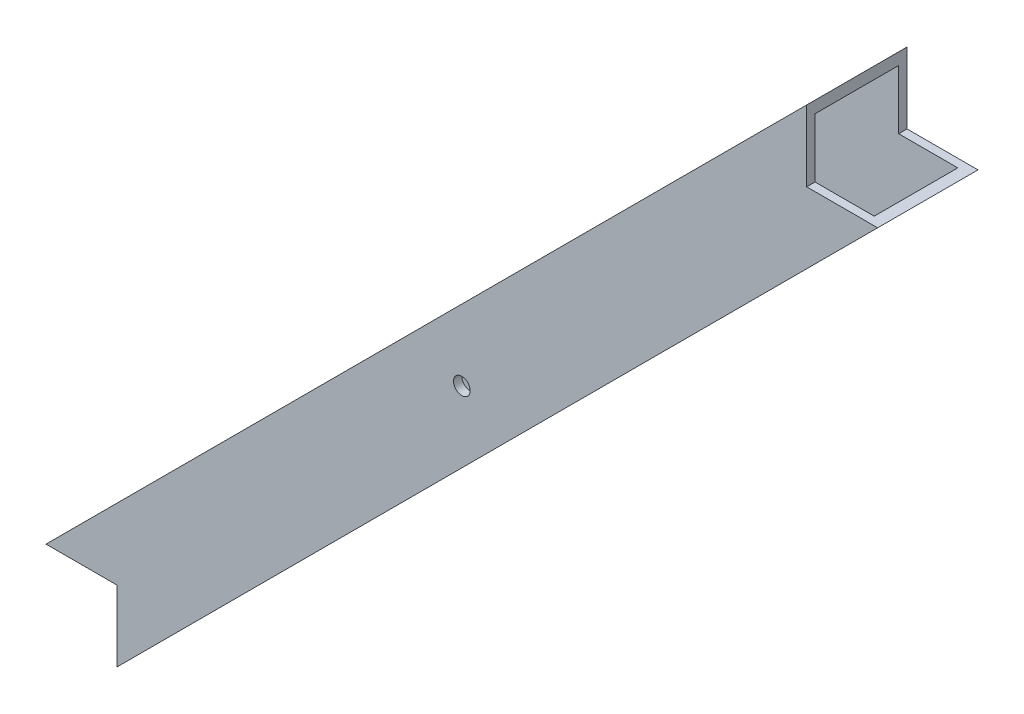
ISO-10303-21;
HEADER;
FILE_DESCRIPTION(('STEP AP214'),'2;1');
FILE_NAME('part.step','',(''),(''),'','','');
FILE_SCHEMA(('AUTOMOTIVE_DESIGN { 1 0 10303 214 1 1 1 1 }'));
ENDSEC;
DATA;
#1=APPLICATION_CONTEXT('core data for automotive mechanical design processes');
#2=APPLICATION_PROTOCOL_DEFINITION('international standard','automotive_design',2000,#1);
#3=PRODUCT_CONTEXT('',#1,'mechanical');
#4=PRODUCT('Part','Part','',(#3));
#5=PRODUCT_RELATED_PRODUCT_CATEGORY('part','',(#4));
#6=PRODUCT_DEFINITION_FORMATION('','',#4);
#7=PRODUCT_DEFINITION_CONTEXT('part definition',#1,'design');
#8=PRODUCT_DEFINITION('design','',#6,#7);
#9=PRODUCT_DEFINITION_SHAPE('','',#8);
#10=(LENGTH_UNIT() NAMED_UNIT(*) SI_UNIT(.MILLI.,.METRE.));
#11=(NAMED_UNIT(*) PLANE_ANGLE_UNIT() SI_UNIT($,.RADIAN.));
#12=(NAMED_UNIT(*) SI_UNIT($,.STERADIAN.) SOLID_ANGLE_UNIT());
#13=UNCERTAINTY_MEASURE_WITH_UNIT(LENGTH_MEASURE(1.E-05),#10,'distance_accuracy_value','');
#14=(GEOMETRIC_REPRESENTATION_CONTEXT(3) GLOBAL_UNCERTAINTY_ASSIGNED_CONTEXT((#13)) GLOBAL_UNIT_ASSIGNED_CONTEXT((#10,
#11,#12)) REPRESENTATION_CONTEXT('',''));
#15=CARTESIAN_POINT('',(0.,0.,0.));
#16=DIRECTION('',(0.,0.,1.));
#17=DIRECTION('',(1.,0.,0.));
#18=AXIS2_PLACEMENT_3D('',#15,#16,#17);
#19=CARTESIAN_POINT('',(150.,150.,-38.1));
#20=DIRECTION('',(0.,0.,1.));
#21=DIRECTION('',(1.,0.,0.));
#22=AXIS2_PLACEMENT_3D('',#19,#20,#21);
#23=CYLINDRICAL_SURFACE('',#22,3.175);
#24=CARTESIAN_POINT('',(150.,150.,0.));
#25=DIRECTION('',(0.,0.,1.));
#26=DIRECTION('',(1.,0.,0.));
#27=AXIS2_PLACEMENT_3D('',#24,#25,#26);
#28=CIRCLE('',#27,3.175);
#29=CARTESIAN_POINT('',(153.175,150.,0.));
#30=VERTEX_POINT('',#29);
#31=EDGE_CURVE('E197',#30,#30,#28,.T.);
#32=ORIENTED_EDGE('',*,*,#31,.T.);
#33=EDGE_LOOP('',(#32));
#34=FACE_BOUND('',#33,.T.);
#35=CARTESIAN_POINT('',(150.,150.,-3.175));
#36=DIRECTION('',(0.,0.,-1.));
#37=DIRECTION('',(-1.,0.,0.));
#38=AXIS2_PLACEMENT_3D('',#35,#36,#37);
#39=CIRCLE('',#38,3.175);
#40=CARTESIAN_POINT('',(146.825,150.,-3.175));
#41=VERTEX_POINT('',#40);
#42=EDGE_CURVE('E249',#41,#41,#39,.F.);
#43=ORIENTED_EDGE('',*,*,#42,.F.);
#44=EDGE_LOOP('',(#43));
#45=FACE_BOUND('',#44,.T.);
#46=ADVANCED_FACE('F40',(#34,#45),#23,.F.);
#47=CARTESIAN_POINT('',(0.,19.05,-38.1));
#48=DIRECTION('',(0.,1.,0.));
#49=DIRECTION('',(0.,0.,1.));
#50=AXIS2_PLACEMENT_3D('',#47,#48,#49);
#51=PLANE('',#50);
#52=DIRECTION('',(0.,0.,1.));
#53=VECTOR('',#52,1.);
#54=CARTESIAN_POINT('',(19.05,19.05,-38.1));
#55=LINE('',#54,#53);
#56=CARTESIAN_POINT('',(19.05,19.05,-38.1));
#57=VERTEX_POINT('',#56);
#58=CARTESIAN_POINT('',(19.05,19.05,-34.925));
#59=VERTEX_POINT('',#58);
#60=EDGE_CURVE('E153',#57,#59,#55,.T.);
#61=ORIENTED_EDGE('',*,*,#60,.T.);
#62=DIRECTION('',(-1.,0.,0.));
#63=VECTOR('',#62,1.);
#64=CARTESIAN_POINT('',(0.,19.05,-34.925));
#65=LINE('',#64,#63);
#66=CARTESIAN_POINT('',(-3.40064030267279,19.0500000000001,-34.925));
#67=VERTEX_POINT('',#66);
#68=EDGE_CURVE('E240',#59,#67,#65,.T.);
#69=ORIENTED_EDGE('',*,*,#68,.T.);
#70=DIRECTION('',(0.,0.,1.));
#71=VECTOR('',#70,1.);
#72=CARTESIAN_POINT('',(-3.40064030267284,19.05,-38.1));
#73=LINE('',#72,#71);
#74=CARTESIAN_POINT('',(-3.40064030267284,19.05,-3.175));
#75=VERTEX_POINT('',#74);
#76=EDGE_CURVE('E201',#67,#75,#73,.T.);
#77=ORIENTED_EDGE('',*,*,#76,.T.);
#78=DIRECTION('',(-1.,0.,0.));
#79=VECTOR('',#78,1.);
#80=CARTESIAN_POINT('',(0.,19.05,-3.175));
#81=LINE('',#80,#79);
#82=CARTESIAN_POINT('',(19.05,19.05,-3.175));
#83=VERTEX_POINT('',#82);
#84=EDGE_CURVE('E253',#83,#75,#81,.T.);
#85=ORIENTED_EDGE('',*,*,#84,.F.);
#86=CARTESIAN_POINT('',(19.05,19.05,0.));
#87=VERTEX_POINT('',#86);
#88=EDGE_CURVE('E148',#83,#87,#55,.T.);
#89=ORIENTED_EDGE('',*,*,#88,.T.);
#90=DIRECTION('',(-1.,0.,0.));
#91=VECTOR('',#90,1.);
#92=CARTESIAN_POINT('',(0.,19.05,0.));
#93=LINE('',#92,#91);
#94=CARTESIAN_POINT('',(-7.8907683632074,19.05,0.));
#95=VERTEX_POINT('',#94);
#96=EDGE_CURVE('E193',#87,#95,#93,.T.);
#97=ORIENTED_EDGE('',*,*,#96,.T.);
#98=DIRECTION('',(0.,0.,1.));
#99=VECTOR('',#98,1.);
#100=CARTESIAN_POINT('',(-7.8907683632074,19.05,-38.1));
#101=LINE('',#100,#99);
#102=CARTESIAN_POINT('',(-7.8907683632074,19.05,-38.1));
#103=VERTEX_POINT('',#102);
#104=EDGE_CURVE('E134',#103,#95,#101,.T.);
#105=ORIENTED_EDGE('',*,*,#104,.F.);
#106=DIRECTION('',(-1.,0.,0.));
#107=VECTOR('',#106,1.);
#108=CARTESIAN_POINT('',(0.,19.05,-38.1));
#109=LINE('',#108,#107);
#110=EDGE_CURVE('E219',#57,#103,#109,.T.);
#111=ORIENTED_EDGE('',*,*,#110,.F.);
#112=EDGE_LOOP('',(#61,#69,#77,#85,#89,#97,#105,#111));
#113=FACE_BOUND('',#112,.T.);
#114=ADVANCED_FACE('F272',(#113),#51,.F.);
#115=CARTESIAN_POINT('',(-13.4703841816037,13.4703841816037,-38.1));
#116=DIRECTION('',(-0.707106781186547,0.707106781186548,0.));
#117=DIRECTION('',(-0.707106781186548,-0.707106781186547,0.));
#118=AXIS2_PLACEMENT_3D('',#115,#116,#117);
#119=PLANE('',#118);
#120=DIRECTION('',(-0.707106781186548,-0.707106781186547,0.));
#121=VECTOR('',#120,1.);
#122=CARTESIAN_POINT('',(-13.4703841816037,13.4703841816037,0.));
#123=LINE('',#122,#121);
#124=CARTESIAN_POINT('',(280.95,307.890768363207,0.));
#125=VERTEX_POINT('',#124);
#126=EDGE_CURVE('E173',#125,#95,#123,.T.);
#127=ORIENTED_EDGE('',*,*,#126,.F.);
#128=DIRECTION('',(0.,0.,1.));
#129=VECTOR('',#128,1.);
#130=CARTESIAN_POINT('',(280.95,307.890768363207,-38.1));
#131=LINE('',#130,#129);
#132=CARTESIAN_POINT('',(280.95,307.890768363207,-38.1));
#133=VERTEX_POINT('',#132);
#134=EDGE_CURVE('E168',#133,#125,#131,.T.);
#135=ORIENTED_EDGE('',*,*,#134,.F.);
#136=DIRECTION('',(-0.707106781186548,-0.707106781186547,0.));
#137=VECTOR('',#136,1.);
#138=CARTESIAN_POINT('',(-13.4703841816037,13.4703841816037,-38.1));
#139=LINE('',#138,#137);
#140=EDGE_CURVE('E202',#133,#103,#139,.T.);
#141=ORIENTED_EDGE('',*,*,#140,.T.);
#142=ORIENTED_EDGE('',*,*,#104,.T.);
#143=EDGE_LOOP('',(#127,#135,#141,#142));
#144=FACE_BOUND('',#143,.T.);
#145=ADVANCED_FACE('F301',(#144),#119,.T.);
#146=CARTESIAN_POINT('',(280.95,0.,-38.1));
#147=DIRECTION('',(-1.,0.,0.));
#148=DIRECTION('',(0.,0.,1.));
#149=AXIS2_PLACEMENT_3D('',#146,#147,#148);
#150=PLANE('',#149);
#151=DIRECTION('',(0.,0.,-1.));
#152=VECTOR('',#151,1.);
#153=CARTESIAN_POINT('',(280.95,303.400640302673,-38.1));
#154=LINE('',#153,#152);
#155=CARTESIAN_POINT('',(280.95,303.400640302673,-3.175));
#156=VERTEX_POINT('',#155);
#157=CARTESIAN_POINT('',(280.95,303.400640302673,-34.925));
#158=VERTEX_POINT('',#157);
#159=EDGE_CURVE('E11',#156,#158,#154,.T.);
#160=ORIENTED_EDGE('',*,*,#159,.T.);
#161=DIRECTION('',(0.,-1.,0.));
#162=VECTOR('',#161,1.);
#163=CARTESIAN_POINT('',(280.95,0.,-34.925));
#164=LINE('',#163,#162);
#165=CARTESIAN_POINT('',(280.95,280.95,-34.925));
#166=VERTEX_POINT('',#165);
#167=EDGE_CURVE('E228',#158,#166,#164,.T.);
#168=ORIENTED_EDGE('',*,*,#167,.T.);
#169=DIRECTION('',(0.,0.,1.));
#170=VECTOR('',#169,1.);
#171=CARTESIAN_POINT('',(280.95,280.95,-38.1));
#172=LINE('',#171,#170);
#173=CARTESIAN_POINT('',(280.95,280.95,-38.1));
#174=VERTEX_POINT('',#173);
#175=EDGE_CURVE('E164',#174,#166,#172,.T.);
#176=ORIENTED_EDGE('',*,*,#175,.F.);
#177=DIRECTION('',(0.,-1.,0.));
#178=VECTOR('',#177,1.);
#179=CARTESIAN_POINT('',(280.95,0.,-38.1));
#180=LINE('',#179,#178);
#181=EDGE_CURVE('E206',#133,#174,#180,.T.);
#182=ORIENTED_EDGE('',*,*,#181,.F.);
#183=ORIENTED_EDGE('',*,*,#134,.T.);
#184=DIRECTION('',(0.,-1.,0.));
#185=VECTOR('',#184,1.);
#186=CARTESIAN_POINT('',(280.95,0.,0.));
#187=LINE('',#186,#185);
#188=CARTESIAN_POINT('',(280.95,280.95,0.));
#189=VERTEX_POINT('',#188);
#190=EDGE_CURVE('E178',#125,#189,#187,.T.);
#191=ORIENTED_EDGE('',*,*,#190,.T.);
#192=CARTESIAN_POINT('',(280.95,280.95,-3.175));
#193=VERTEX_POINT('',#192);
#194=EDGE_CURVE('E163',#193,#189,#172,.T.);
#195=ORIENTED_EDGE('',*,*,#194,.F.);
#196=DIRECTION('',(0.,-1.,0.));
#197=VECTOR('',#196,1.);
#198=CARTESIAN_POINT('',(280.95,0.,-3.175));
#199=LINE('',#198,#197);
#200=EDGE_CURVE('E244',#156,#193,#199,.T.);
#201=ORIENTED_EDGE('',*,*,#200,.F.);
#202=EDGE_LOOP('',(#160,#168,#176,#182,#183,#191,#195,#201));
#203=FACE_BOUND('',#202,.T.);
#204=ADVANCED_FACE('F285',(#203),#150,.F.);
#205=CARTESIAN_POINT('',(0.,280.95,-38.1));
#206=DIRECTION('',(0.,-1.,0.));
#207=DIRECTION('',(0.,0.,-1.));
#208=AXIS2_PLACEMENT_3D('',#205,#206,#207);
#209=PLANE('',#208);
#210=ORIENTED_EDGE('',*,*,#175,.T.);
#211=DIRECTION('',(1.,0.,0.));
#212=VECTOR('',#211,1.);
#213=CARTESIAN_POINT('',(0.,280.95,-34.925));
#214=LINE('',#213,#212);
#215=CARTESIAN_POINT('',(303.400640302673,280.95,-34.925));
#216=VERTEX_POINT('',#215);
#217=EDGE_CURVE('E232',#166,#216,#214,.T.);
#218=ORIENTED_EDGE('',*,*,#217,.T.);
#219=DIRECTION('',(0.,0.,-1.));
#220=VECTOR('',#219,1.);
#221=CARTESIAN_POINT('',(303.400640302673,280.95,-38.1));
#222=LINE('',#221,#220);
#223=CARTESIAN_POINT('',(303.400640302673,280.95,-3.175));
#224=VERTEX_POINT('',#223);
#225=EDGE_CURVE('E256',#224,#216,#222,.T.);
#226=ORIENTED_EDGE('',*,*,#225,.F.);
#227=DIRECTION('',(1.,0.,0.));
#228=VECTOR('',#227,1.);
#229=CARTESIAN_POINT('',(0.,280.95,-3.175));
#230=LINE('',#229,#228);
#231=EDGE_CURVE('E140',#193,#224,#230,.T.);
#232=ORIENTED_EDGE('',*,*,#231,.F.);
#233=ORIENTED_EDGE('',*,*,#194,.T.);
#234=DIRECTION('',(1.,0.,0.));
#235=VECTOR('',#234,1.);
#236=CARTESIAN_POINT('',(0.,280.95,0.));
#237=LINE('',#236,#235);
#238=CARTESIAN_POINT('',(307.890768363207,280.95,0.));
#239=VERTEX_POINT('',#238);
#240=EDGE_CURVE('E182',#189,#239,#237,.T.);
#241=ORIENTED_EDGE('',*,*,#240,.T.);
#242=DIRECTION('',(0.,0.,1.));
#243=VECTOR('',#242,1.);
#244=CARTESIAN_POINT('',(307.890768363207,280.95,-38.1));
#245=LINE('',#244,#243);
#246=CARTESIAN_POINT('',(307.890768363207,280.95,-38.1));
#247=VERTEX_POINT('',#246);
#248=EDGE_CURVE('E160',#247,#239,#245,.T.);
#249=ORIENTED_EDGE('',*,*,#248,.F.);
#250=DIRECTION('',(1.,0.,0.));
#251=VECTOR('',#250,1.);
#252=CARTESIAN_POINT('',(0.,280.95,-38.1));
#253=LINE('',#252,#251);
#254=EDGE_CURVE('E209',#174,#247,#253,.T.);
#255=ORIENTED_EDGE('',*,*,#254,.F.);
#256=EDGE_LOOP('',(#210,#218,#226,#232,#233,#241,#249,#255));
#257=FACE_BOUND('',#256,.T.);
#258=ADVANCED_FACE('F279',(#257),#209,.F.);
#259=CARTESIAN_POINT('',(13.4703841816038,-13.4703841816038,-38.1));
#260=DIRECTION('',(0.707106781186548,-0.707106781186548,0.));
#261=DIRECTION('',(0.707106781186548,0.707106781186548,0.));
#262=AXIS2_PLACEMENT_3D('',#259,#260,#261);
#263=PLANE('',#262);
#264=DIRECTION('',(0.707106781186548,0.707106781186548,0.));
#265=VECTOR('',#264,1.);
#266=CARTESIAN_POINT('',(13.4703841816038,-13.4703841816038,0.));
#267=LINE('',#266,#265);
#268=CARTESIAN_POINT('',(19.05,-7.89076836320756,0.));
#269=VERTEX_POINT('',#268);
#270=EDGE_CURVE('E186',#269,#239,#267,.T.);
#271=ORIENTED_EDGE('',*,*,#270,.F.);
#272=DIRECTION('',(0.,0.,1.));
#273=VECTOR('',#272,1.);
#274=CARTESIAN_POINT('',(19.05,-7.89076836320756,-38.1));
#275=LINE('',#274,#273);
#276=CARTESIAN_POINT('',(19.05,-7.89076836320756,-38.1));
#277=VERTEX_POINT('',#276);
#278=EDGE_CURVE('E157',#277,#269,#275,.T.);
#279=ORIENTED_EDGE('',*,*,#278,.F.);
#280=DIRECTION('',(0.707106781186548,0.707106781186548,0.));
#281=VECTOR('',#280,1.);
#282=CARTESIAN_POINT('',(13.4703841816038,-13.4703841816038,-38.1));
#283=LINE('',#282,#281);
#284=EDGE_CURVE('E212',#277,#247,#283,.T.);
#285=ORIENTED_EDGE('',*,*,#284,.T.);
#286=ORIENTED_EDGE('',*,*,#248,.T.);
#287=EDGE_LOOP('',(#271,#279,#285,#286));
#288=FACE_BOUND('',#287,.T.);
#289=ADVANCED_FACE('F305',(#288),#263,.T.);
#290=CARTESIAN_POINT('',(150.,150.,-34.925));
#291=DIRECTION('',(0.,0.,-1.));
#292=DIRECTION('',(-1.,0.,0.));
#293=AXIS2_PLACEMENT_3D('',#290,#291,#292);
#294=CIRCLE('',#293,3.175);
#295=CARTESIAN_POINT('',(146.825,150.,-34.925));
#296=VERTEX_POINT('',#295);
#297=EDGE_CURVE('E236',#296,#296,#294,.F.);
#298=ORIENTED_EDGE('',*,*,#297,.T.);
#299=EDGE_LOOP('',(#298));
#300=FACE_BOUND('',#299,.T.);
#301=CARTESIAN_POINT('',(150.,150.,-38.1));
#302=DIRECTION('',(0.,0.,1.));
#303=DIRECTION('',(1.,0.,0.));
#304=AXIS2_PLACEMENT_3D('',#301,#302,#303);
#305=CIRCLE('',#304,3.175);
#306=CARTESIAN_POINT('',(153.175,150.,-38.1));
#307=VERTEX_POINT('',#306);
#308=EDGE_CURVE('E177',#307,#307,#305,.T.);
#309=ORIENTED_EDGE('',*,*,#308,.F.);
#310=EDGE_LOOP('',(#309));
#311=FACE_BOUND('',#310,.T.);
#312=ADVANCED_FACE('F42',(#300,#311),#23,.F.);
#313=CARTESIAN_POINT('',(19.05,0.,-38.1));
#314=DIRECTION('',(1.,0.,0.));
#315=DIRECTION('',(0.,0.,-1.));
#316=AXIS2_PLACEMENT_3D('',#313,#314,#315);
#317=PLANE('',#316);
#318=DIRECTION('',(0.,0.,1.));
#319=VECTOR('',#318,1.);
#320=CARTESIAN_POINT('',(19.05,-3.40064030267284,-38.1));
#321=LINE('',#320,#319);
#322=CARTESIAN_POINT('',(19.05,-3.40064030267284,-34.925));
#323=VERTEX_POINT('',#322);
#324=CARTESIAN_POINT('',(19.0500000000001,-3.40064030267279,-3.175));
#325=VERTEX_POINT('',#324);
#326=EDGE_CURVE('E127',#323,#325,#321,.T.);
#327=ORIENTED_EDGE('',*,*,#326,.F.);
#328=DIRECTION('',(0.,1.,0.));
#329=VECTOR('',#328,1.);
#330=CARTESIAN_POINT('',(19.05,0.,-34.925));
#331=LINE('',#330,#329);
#332=EDGE_CURVE('E49',#323,#59,#331,.T.);
#333=ORIENTED_EDGE('',*,*,#332,.T.);
#334=ORIENTED_EDGE('',*,*,#60,.F.);
#335=DIRECTION('',(0.,1.,0.));
#336=VECTOR('',#335,1.);
#337=CARTESIAN_POINT('',(19.05,0.,-38.1));
#338=LINE('',#337,#336);
#339=EDGE_CURVE('E216',#277,#57,#338,.T.);
#340=ORIENTED_EDGE('',*,*,#339,.F.);
#341=ORIENTED_EDGE('',*,*,#278,.T.);
#342=DIRECTION('',(0.,1.,0.));
#343=VECTOR('',#342,1.);
#344=CARTESIAN_POINT('',(19.05,0.,0.));
#345=LINE('',#344,#343);
#346=EDGE_CURVE('E190',#269,#87,#345,.T.);
#347=ORIENTED_EDGE('',*,*,#346,.T.);
#348=ORIENTED_EDGE('',*,*,#88,.F.);
#349=DIRECTION('',(0.,1.,0.));
#350=VECTOR('',#349,1.);
#351=CARTESIAN_POINT('',(19.05,0.,-3.175));
#352=LINE('',#351,#350);
#353=EDGE_CURVE('E133',#325,#83,#352,.T.);
#354=ORIENTED_EDGE('',*,*,#353,.F.);
#355=EDGE_LOOP('',(#327,#333,#334,#340,#341,#347,#348,#354));
#356=FACE_BOUND('',#355,.T.);
#357=ADVANCED_FACE('F146',(#356),#317,.F.);
#358=CARTESIAN_POINT('',(0.,0.,-38.1));
#359=DIRECTION('',(0.,0.,1.));
#360=DIRECTION('',(1.,0.,0.));
#361=AXIS2_PLACEMENT_3D('',#358,#359,#360);
#362=PLANE('',#361);
#363=ORIENTED_EDGE('',*,*,#308,.T.);
#364=EDGE_LOOP('',(#363));
#365=FACE_BOUND('',#364,.T.);
#366=ORIENTED_EDGE('',*,*,#110,.T.);
#367=ORIENTED_EDGE('',*,*,#140,.F.);
#368=ORIENTED_EDGE('',*,*,#181,.T.);
#369=ORIENTED_EDGE('',*,*,#254,.T.);
#370=ORIENTED_EDGE('',*,*,#284,.F.);
#371=ORIENTED_EDGE('',*,*,#339,.T.);
#372=EDGE_LOOP('',(#366,#367,#368,#369,#370,#371));
#373=FACE_BOUND('',#372,.T.);
#374=ADVANCED_FACE('F303',(#365,#373),#362,.F.);
#375=CARTESIAN_POINT('',(0.,0.,0.));
#376=DIRECTION('',(0.,0.,1.));
#377=DIRECTION('',(1.,0.,0.));
#378=AXIS2_PLACEMENT_3D('',#375,#376,#377);
#379=PLANE('',#378);
#380=ORIENTED_EDGE('',*,*,#31,.F.);
#381=EDGE_LOOP('',(#380));
#382=FACE_BOUND('',#381,.T.);
#383=ORIENTED_EDGE('',*,*,#96,.F.);
#384=ORIENTED_EDGE('',*,*,#346,.F.);
#385=ORIENTED_EDGE('',*,*,#270,.T.);
#386=ORIENTED_EDGE('',*,*,#240,.F.);
#387=ORIENTED_EDGE('',*,*,#190,.F.);
#388=ORIENTED_EDGE('',*,*,#126,.T.);
#389=EDGE_LOOP('',(#383,#384,#385,#386,#387,#388));
#390=FACE_BOUND('',#389,.T.);
#391=ADVANCED_FACE('F296',(#382,#390),#379,.T.);
#392=CARTESIAN_POINT('',(296.665448211871,319.116088514544,-3.175));
#393=DIRECTION('',(-0.707106781186547,0.707106781186547,0.));
#394=DIRECTION('',(-0.707106781186548,-0.707106781186548,0.));
#395=AXIS2_PLACEMENT_3D('',#392,#393,#394);
#396=PLANE('',#395);
#397=DIRECTION('',(-0.707106781186547,-0.707106781186547,0.));
#398=VECTOR('',#397,1.);
#399=CARTESIAN_POINT('',(296.665448211871,319.116088514544,-34.925));
#400=LINE('',#399,#398);
#401=EDGE_CURVE('E259',#158,#67,#400,.T.);
#402=ORIENTED_EDGE('',*,*,#401,.F.);
#403=ORIENTED_EDGE('',*,*,#159,.F.);
#404=DIRECTION('',(-0.707106781186547,-0.707106781186547,0.));
#405=VECTOR('',#404,1.);
#406=CARTESIAN_POINT('',(296.665448211871,319.116088514544,-3.175));
#407=LINE('',#406,#405);
#408=EDGE_CURVE('E143',#156,#75,#407,.T.);
#409=ORIENTED_EDGE('',*,*,#408,.T.);
#410=ORIENTED_EDGE('',*,*,#76,.F.);
#411=EDGE_LOOP('',(#402,#403,#409,#410));
#412=FACE_BOUND('',#411,.T.);
#413=ADVANCED_FACE('F290',(#412),#396,.F.);
#414=CARTESIAN_POINT('',(296.665448211871,319.116088514544,-34.925));
#415=DIRECTION('',(0.,0.,-1.));
#416=DIRECTION('',(-1.,0.,0.));
#417=AXIS2_PLACEMENT_3D('',#414,#415,#416);
#418=PLANE('',#417);
#419=ORIENTED_EDGE('',*,*,#297,.F.);
#420=EDGE_LOOP('',(#419));
#421=FACE_BOUND('',#420,.T.);
#422=ORIENTED_EDGE('',*,*,#401,.T.);
#423=ORIENTED_EDGE('',*,*,#68,.F.);
#424=ORIENTED_EDGE('',*,*,#332,.F.);
#425=DIRECTION('',(-0.707106781186547,-0.707106781186547,0.));
#426=VECTOR('',#425,1.);
#427=CARTESIAN_POINT('',(319.116088514544,296.665448211871,-34.925));
#428=LINE('',#427,#426);
#429=EDGE_CURVE('E61',#216,#323,#428,.T.);
#430=ORIENTED_EDGE('',*,*,#429,.F.);
#431=ORIENTED_EDGE('',*,*,#217,.F.);
#432=ORIENTED_EDGE('',*,*,#167,.F.);
#433=EDGE_LOOP('',(#422,#423,#424,#430,#431,#432));
#434=FACE_BOUND('',#433,.T.);
#435=ADVANCED_FACE('F269',(#421,#434),#418,.F.);
#436=CARTESIAN_POINT('',(296.665448211871,319.116088514544,-3.175));
#437=DIRECTION('',(0.,0.,-1.));
#438=DIRECTION('',(-1.,0.,0.));
#439=AXIS2_PLACEMENT_3D('',#436,#437,#438);
#440=PLANE('',#439);
#441=ORIENTED_EDGE('',*,*,#42,.T.);
#442=EDGE_LOOP('',(#441));
#443=FACE_BOUND('',#442,.T.);
#444=ORIENTED_EDGE('',*,*,#200,.T.);
#445=ORIENTED_EDGE('',*,*,#231,.T.);
#446=DIRECTION('',(-0.707106781186547,-0.707106781186547,0.));
#447=VECTOR('',#446,1.);
#448=CARTESIAN_POINT('',(319.116088514544,296.665448211871,-3.175));
#449=LINE('',#448,#447);
#450=EDGE_CURVE('E56',#224,#325,#449,.T.);
#451=ORIENTED_EDGE('',*,*,#450,.T.);
#452=ORIENTED_EDGE('',*,*,#353,.T.);
#453=ORIENTED_EDGE('',*,*,#84,.T.);
#454=ORIENTED_EDGE('',*,*,#408,.F.);
#455=EDGE_LOOP('',(#444,#445,#451,#452,#453,#454));
#456=FACE_BOUND('',#455,.T.);
#457=ADVANCED_FACE('F137',(#443,#456),#440,.T.);
#458=CARTESIAN_POINT('',(319.116088514544,296.665448211871,-3.175));
#459=DIRECTION('',(-0.707106781186547,0.707106781186547,0.));
#460=DIRECTION('',(-0.707106781186548,-0.707106781186548,0.));
#461=AXIS2_PLACEMENT_3D('',#458,#459,#460);
#462=PLANE('',#461);
#463=ORIENTED_EDGE('',*,*,#225,.T.);
#464=ORIENTED_EDGE('',*,*,#429,.T.);
#465=ORIENTED_EDGE('',*,*,#326,.T.);
#466=ORIENTED_EDGE('',*,*,#450,.F.);
#467=EDGE_LOOP('',(#463,#464,#465,#466));
#468=FACE_BOUND('',#467,.T.);
#469=ADVANCED_FACE('F128',(#468),#462,.T.);
#470=CLOSED_SHELL('',(#46,#114,#145,#204,#258,#289,#312,#357,#374,#391,#413,#435,#457,#469));
#471=MANIFOLD_SOLID_BREP('B2',#470);
#472=ADVANCED_BREP_SHAPE_REPRESENTATION('',(#18,#471),#14);
#473=SHAPE_DEFINITION_REPRESENTATION(#9,#472);
ENDSEC;
END-ISO-10303-21;
